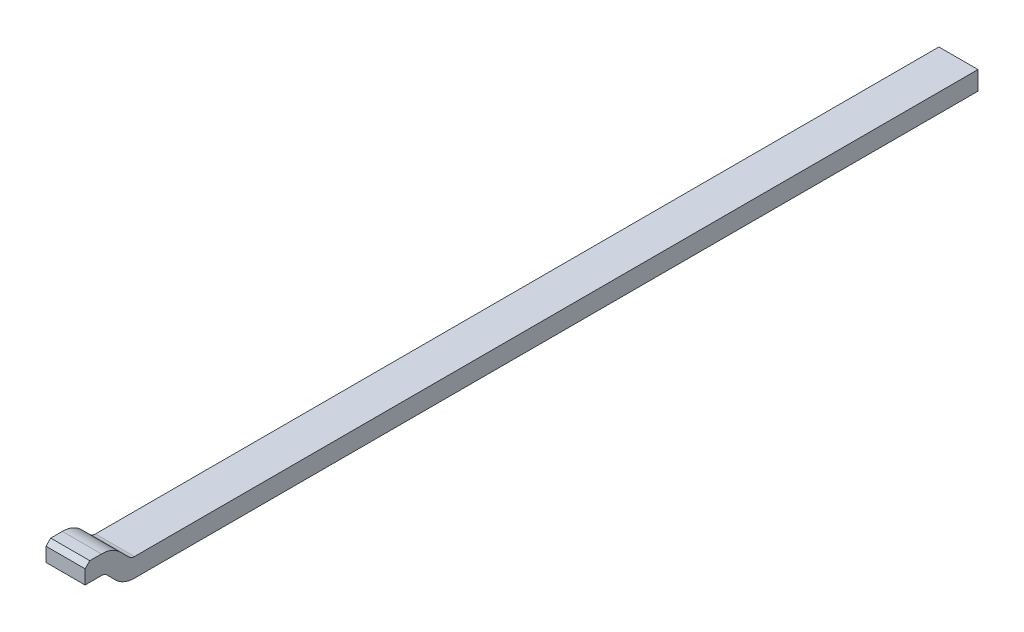
ISO-10303-21;
HEADER;
FILE_DESCRIPTION(('STEP AP214'),'2;1');
FILE_NAME('part.step','',(''),(''),'','','');
FILE_SCHEMA(('AUTOMOTIVE_DESIGN { 1 0 10303 214 1 1 1 1 }'));
ENDSEC;
DATA;
#1=APPLICATION_CONTEXT('core data for automotive mechanical design processes');
#2=APPLICATION_PROTOCOL_DEFINITION('international standard','automotive_design',2000,#1);
#3=PRODUCT_CONTEXT('',#1,'mechanical');
#4=PRODUCT('Part','Part','',(#3));
#5=PRODUCT_RELATED_PRODUCT_CATEGORY('part','',(#4));
#6=PRODUCT_DEFINITION_FORMATION('','',#4);
#7=PRODUCT_DEFINITION_CONTEXT('part definition',#1,'design');
#8=PRODUCT_DEFINITION('design','',#6,#7);
#9=PRODUCT_DEFINITION_SHAPE('','',#8);
#10=(LENGTH_UNIT() NAMED_UNIT(*) SI_UNIT(.MILLI.,.METRE.));
#11=(NAMED_UNIT(*) PLANE_ANGLE_UNIT() SI_UNIT($,.RADIAN.));
#12=(NAMED_UNIT(*) SI_UNIT($,.STERADIAN.) SOLID_ANGLE_UNIT());
#13=UNCERTAINTY_MEASURE_WITH_UNIT(LENGTH_MEASURE(1.E-05),#10,'distance_accuracy_value','');
#14=(GEOMETRIC_REPRESENTATION_CONTEXT(3) GLOBAL_UNCERTAINTY_ASSIGNED_CONTEXT((#13)) GLOBAL_UNIT_ASSIGNED_CONTEXT((#10,
#11,#12)) REPRESENTATION_CONTEXT('',''));
#15=CARTESIAN_POINT('',(0.,0.,0.));
#16=DIRECTION('',(0.,0.,1.));
#17=DIRECTION('',(1.,0.,0.));
#18=AXIS2_PLACEMENT_3D('',#15,#16,#17);
#19=CARTESIAN_POINT('',(16.16210823521,13.39951558355,-5.731698833076));
#20=DIRECTION('',(1.,0.,0.));
#21=DIRECTION('',(0.,0.,-1.));
#22=AXIS2_PLACEMENT_3D('',#19,#20,#21);
#23=PLANE('',#22);
#24=DIRECTION('',(0.,0.,-1.));
#25=VECTOR('',#24,1.);
#26=CARTESIAN_POINT('',(16.16210820552,12.93951558355,-11.38169883308));
#27=LINE('',#26,#25);
#28=CARTESIAN_POINT('',(16.1621082058651,12.93951558355,-5.77711513867901));
#29=VERTEX_POINT('',#28);
#30=CARTESIAN_POINT('',(16.1621082205483,12.93951558355,-11.17169883308));
#31=VERTEX_POINT('',#30);
#32=EDGE_CURVE('E28',#29,#31,#27,.T.);
#33=ORIENTED_EDGE('',*,*,#32,.T.);
#34=DIRECTION('',(0.,1.,0.));
#35=VECTOR('',#34,1.);
#36=CARTESIAN_POINT('',(16.16210823521,11.48941215274,-11.17169883308));
#37=LINE('',#36,#35);
#38=CARTESIAN_POINT('',(16.1621082205483,12.81951558355,-11.17169883308));
#39=VERTEX_POINT('',#38);
#40=EDGE_CURVE('E191',#39,#31,#37,.T.);
#41=ORIENTED_EDGE('',*,*,#40,.F.);
#42=DIRECTION('',(0.,0.,-1.));
#43=VECTOR('',#42,1.);
#44=CARTESIAN_POINT('',(16.16210820552,12.81951558355,-5.731698833076));
#45=LINE('',#44,#43);
#46=CARTESIAN_POINT('',(16.1621082058651,12.81951558355,-5.77711513867905));
#47=VERTEX_POINT('',#46);
#48=EDGE_CURVE('E227',#47,#39,#45,.T.);
#49=ORIENTED_EDGE('',*,*,#48,.F.);
#50=CARTESIAN_POINT('',(16.16210820552,12.98951558355,-5.777115138679));
#51=DIRECTION('',(1.,0.,0.));
#52=DIRECTION('',(0.,0.,1.));
#53=AXIS2_PLACEMENT_3D('',#50,#51,#52);
#54=CIRCLE('',#53,0.17);
#55=CARTESIAN_POINT('',(16.1621082058651,12.8693074307492,-5.65690698587737));
#56=VERTEX_POINT('',#55);
#57=EDGE_CURVE('E21',#56,#47,#54,.T.);
#58=ORIENTED_EDGE('',*,*,#57,.F.);
#59=DIRECTION('',(0.,-0.707106781180048,-0.707106781193047));
#60=VECTOR('',#59,1.);
#61=CARTESIAN_POINT('',(16.16210820552,12.92487092261,-5.601343494017));
#62=LINE('',#61,#60);
#63=CARTESIAN_POINT('',(16.1621082058651,12.9248709226098,-5.60134349401678));
#64=VERTEX_POINT('',#63);
#65=EDGE_CURVE('E201',#64,#56,#62,.T.);
#66=ORIENTED_EDGE('',*,*,#65,.F.);
#67=CARTESIAN_POINT('',(16.16210820552,12.88951558355,-5.565988154957));
#68=DIRECTION('',(-1.,0.,0.));
#69=DIRECTION('',(0.,0.,1.));
#70=AXIS2_PLACEMENT_3D('',#67,#68,#69);
#71=CIRCLE('',#70,0.05);
#72=CARTESIAN_POINT('',(16.1621082058651,12.93951558355,-5.565988154957));
#73=VERTEX_POINT('',#72);
#74=EDGE_CURVE('E180',#73,#64,#71,.T.);
#75=ORIENTED_EDGE('',*,*,#74,.F.);
#76=DIRECTION('',(0.,0.,-1.));
#77=VECTOR('',#76,1.);
#78=CARTESIAN_POINT('',(16.16210820552,12.93951558355,-5.731698833076));
#79=LINE('',#78,#77);
#80=CARTESIAN_POINT('',(16.1621082058651,12.93951558355,-5.461404460561));
#81=VERTEX_POINT('',#80);
#82=EDGE_CURVE('E181',#81,#73,#79,.T.);
#83=ORIENTED_EDGE('',*,*,#82,.F.);
#84=DIRECTION('',(0.,-1.,0.));
#85=VECTOR('',#84,1.);
#86=CARTESIAN_POINT('',(16.16210820552,12.93951558355,-5.461404460561));
#87=LINE('',#86,#85);
#88=CARTESIAN_POINT('',(16.1621082058651,13.02951558355,-5.461404460561));
#89=VERTEX_POINT('',#88);
#90=EDGE_CURVE('E234',#89,#81,#87,.T.);
#91=ORIENTED_EDGE('',*,*,#90,.F.);
#92=DIRECTION('',(0.,-0.707106781186548,0.707106781186548));
#93=VECTOR('',#92,1.);
#94=CARTESIAN_POINT('',(16.16210820552,13.05951558355,-5.491404460561));
#95=LINE('',#94,#93);
#96=CARTESIAN_POINT('',(16.1621082058651,13.05951558355,-5.491404460561));
#97=VERTEX_POINT('',#96);
#98=EDGE_CURVE('E186',#97,#89,#95,.T.);
#99=ORIENTED_EDGE('',*,*,#98,.F.);
#100=DIRECTION('',(0.,0.,1.));
#101=VECTOR('',#100,1.);
#102=CARTESIAN_POINT('',(16.16210820552,13.05951558355,-5.731698833076));
#103=LINE('',#102,#101);
#104=CARTESIAN_POINT('',(16.1621082058651,13.05951558355,-5.565988154957));
#105=VERTEX_POINT('',#104);
#106=EDGE_CURVE('E242',#105,#97,#103,.T.);
#107=ORIENTED_EDGE('',*,*,#106,.F.);
#108=CARTESIAN_POINT('',(16.16210820552,12.88951558355,-5.565988154957));
#109=DIRECTION('',(1.,0.,0.));
#110=DIRECTION('',(0.,0.,1.));
#111=AXIS2_PLACEMENT_3D('',#108,#109,#110);
#112=CIRCLE('',#111,0.17);
#113=CARTESIAN_POINT('',(16.1621082058651,13.0097237363508,-5.68619630775937));
#114=VERTEX_POINT('',#113);
#115=EDGE_CURVE('E247',#114,#105,#112,.T.);
#116=ORIENTED_EDGE('',*,*,#115,.F.);
#117=DIRECTION('',(0.,0.707106781180048,0.707106781193047));
#118=VECTOR('',#117,1.);
#119=CARTESIAN_POINT('',(16.16210820552,12.95416024449,-5.74175979962));
#120=LINE('',#119,#118);
#121=CARTESIAN_POINT('',(16.1621082058651,12.9541602444904,-5.74175979962039));
#122=VERTEX_POINT('',#121);
#123=EDGE_CURVE('E174',#122,#114,#120,.T.);
#124=ORIENTED_EDGE('',*,*,#123,.F.);
#125=CARTESIAN_POINT('',(16.16210820552,12.98951558355,-5.777115138679));
#126=DIRECTION('',(-1.,0.,0.));
#127=DIRECTION('',(0.,0.,1.));
#128=AXIS2_PLACEMENT_3D('',#125,#126,#127);
#129=CIRCLE('',#128,0.05);
#130=EDGE_CURVE('E205',#29,#122,#129,.T.);
#131=ORIENTED_EDGE('',*,*,#130,.F.);
#132=EDGE_LOOP('',(#33,#41,#49,#58,#66,#75,#83,#91,#99,#107,#116,#124,#131));
#133=FACE_BOUND('',#132,.T.);
#134=ADVANCED_FACE('F17',(#133),#23,.F.);
#135=CARTESIAN_POINT('',(16.41210823521,13.67951558355,-12.98169883308));
#136=DIRECTION('',(1.,0.,0.));
#137=DIRECTION('',(0.,0.,-1.));
#138=AXIS2_PLACEMENT_3D('',#135,#136,#137);
#139=PLANE('',#138);
#140=DIRECTION('',(0.,1.,0.));
#141=VECTOR('',#140,1.);
#142=CARTESIAN_POINT('',(16.41210823521,11.48941215274,-11.17169883308));
#143=LINE('',#142,#141);
#144=CARTESIAN_POINT('',(16.4121082205483,12.81951558355,-11.17169883308));
#145=VERTEX_POINT('',#144);
#146=CARTESIAN_POINT('',(16.4121082205483,12.93951558355,-11.17169883308));
#147=VERTEX_POINT('',#146);
#148=EDGE_CURVE('E194',#145,#147,#143,.T.);
#149=ORIENTED_EDGE('',*,*,#148,.T.);
#150=DIRECTION('',(0.,0.,1.));
#151=VECTOR('',#150,1.);
#152=CARTESIAN_POINT('',(16.41210820552,12.93951558355,-12.98169883308));
#153=LINE('',#152,#151);
#154=CARTESIAN_POINT('',(16.4121082058651,12.93951558355,-5.77711513867901));
#155=VERTEX_POINT('',#154);
#156=EDGE_CURVE('E11',#147,#155,#153,.T.);
#157=ORIENTED_EDGE('',*,*,#156,.T.);
#158=CARTESIAN_POINT('',(16.41210820552,12.98951558355,-5.777115138679));
#159=DIRECTION('',(-1.,0.,0.));
#160=DIRECTION('',(0.,0.,1.));
#161=AXIS2_PLACEMENT_3D('',#158,#159,#160);
#162=CIRCLE('',#161,0.05);
#163=CARTESIAN_POINT('',(16.4121082058651,12.9541602444904,-5.74175979962039));
#164=VERTEX_POINT('',#163);
#165=EDGE_CURVE('E208',#155,#164,#162,.T.);
#166=ORIENTED_EDGE('',*,*,#165,.T.);
#167=DIRECTION('',(0.,0.707106781180048,0.707106781193047));
#168=VECTOR('',#167,1.);
#169=CARTESIAN_POINT('',(16.41210820552,12.95416024449,-5.74175979962));
#170=LINE('',#169,#168);
#171=CARTESIAN_POINT('',(16.4121082058651,13.0097237363508,-5.68619630775937));
#172=VERTEX_POINT('',#171);
#173=EDGE_CURVE('E243',#164,#172,#170,.T.);
#174=ORIENTED_EDGE('',*,*,#173,.T.);
#175=CARTESIAN_POINT('',(16.41210820552,12.88951558355,-5.565988154957));
#176=DIRECTION('',(1.,0.,0.));
#177=DIRECTION('',(0.,0.,1.));
#178=AXIS2_PLACEMENT_3D('',#175,#176,#177);
#179=CIRCLE('',#178,0.17);
#180=CARTESIAN_POINT('',(16.4121082058651,13.05951558355,-5.565988154957));
#181=VERTEX_POINT('',#180);
#182=EDGE_CURVE('E210',#172,#181,#179,.T.);
#183=ORIENTED_EDGE('',*,*,#182,.T.);
#184=DIRECTION('',(0.,0.,1.));
#185=VECTOR('',#184,1.);
#186=CARTESIAN_POINT('',(16.41210820552,13.05951558355,-12.98169883308));
#187=LINE('',#186,#185);
#188=CARTESIAN_POINT('',(16.4121082058651,13.05951558355,-5.491404460561));
#189=VERTEX_POINT('',#188);
#190=EDGE_CURVE('E214',#181,#189,#187,.T.);
#191=ORIENTED_EDGE('',*,*,#190,.T.);
#192=DIRECTION('',(0.,-0.707106781186548,0.707106781186548));
#193=VECTOR('',#192,1.);
#194=CARTESIAN_POINT('',(16.41210820552,13.05951558355,-5.491404460561));
#195=LINE('',#194,#193);
#196=CARTESIAN_POINT('',(16.4121082058651,13.02951558355,-5.461404460561));
#197=VERTEX_POINT('',#196);
#198=EDGE_CURVE('E235',#189,#197,#195,.T.);
#199=ORIENTED_EDGE('',*,*,#198,.T.);
#200=DIRECTION('',(0.,-1.,0.));
#201=VECTOR('',#200,1.);
#202=CARTESIAN_POINT('',(16.41210820552,12.65951558355,-5.461404460561));
#203=LINE('',#202,#201);
#204=CARTESIAN_POINT('',(16.4121082058651,12.93951558355,-5.461404460561));
#205=VERTEX_POINT('',#204);
#206=EDGE_CURVE('E184',#197,#205,#203,.T.);
#207=ORIENTED_EDGE('',*,*,#206,.T.);
#208=DIRECTION('',(0.,0.,-1.));
#209=VECTOR('',#208,1.);
#210=CARTESIAN_POINT('',(16.41210820552,12.93951558355,-12.98169883308));
#211=LINE('',#210,#209);
#212=CARTESIAN_POINT('',(16.4121082058651,12.93951558355,-5.565988154957));
#213=VERTEX_POINT('',#212);
#214=EDGE_CURVE('E179',#205,#213,#211,.T.);
#215=ORIENTED_EDGE('',*,*,#214,.T.);
#216=CARTESIAN_POINT('',(16.41210820552,12.88951558355,-5.565988154957));
#217=DIRECTION('',(-1.,0.,0.));
#218=DIRECTION('',(0.,0.,1.));
#219=AXIS2_PLACEMENT_3D('',#216,#217,#218);
#220=CIRCLE('',#219,0.05);
#221=CARTESIAN_POINT('',(16.4121082058651,12.9248709226098,-5.60134349401678));
#222=VERTEX_POINT('',#221);
#223=EDGE_CURVE('E176',#213,#222,#220,.T.);
#224=ORIENTED_EDGE('',*,*,#223,.T.);
#225=DIRECTION('',(0.,-0.707106781180048,-0.707106781193047));
#226=VECTOR('',#225,1.);
#227=CARTESIAN_POINT('',(16.41210820552,12.92487092261,-5.601343494017));
#228=LINE('',#227,#226);
#229=CARTESIAN_POINT('',(16.4121082058651,12.8693074307492,-5.65690698587737));
#230=VERTEX_POINT('',#229);
#231=EDGE_CURVE('E157',#222,#230,#228,.T.);
#232=ORIENTED_EDGE('',*,*,#231,.T.);
#233=CARTESIAN_POINT('',(16.41210820552,12.98951558355,-5.777115138679));
#234=DIRECTION('',(1.,0.,0.));
#235=DIRECTION('',(0.,0.,1.));
#236=AXIS2_PLACEMENT_3D('',#233,#234,#235);
#237=CIRCLE('',#236,0.17);
#238=CARTESIAN_POINT('',(16.4121082058651,12.81951558355,-5.77711513867905));
#239=VERTEX_POINT('',#238);
#240=EDGE_CURVE('E154',#230,#239,#237,.T.);
#241=ORIENTED_EDGE('',*,*,#240,.T.);
#242=DIRECTION('',(0.,0.,-1.));
#243=VECTOR('',#242,1.);
#244=CARTESIAN_POINT('',(16.41210820552,12.81951558355,-12.98169883308));
#245=LINE('',#244,#243);
#246=EDGE_CURVE('E139',#239,#145,#245,.T.);
#247=ORIENTED_EDGE('',*,*,#246,.T.);
#248=EDGE_LOOP('',(#149,#157,#166,#174,#183,#191,#199,#207,#215,#224,#232,#241,#247));
#249=FACE_BOUND('',#248,.T.);
#250=ADVANCED_FACE('F155',(#249),#139,.T.);
#251=CARTESIAN_POINT('',(12.51210817501,12.93951558355,-11.38169883308));
#252=DIRECTION('',(0.,-1.,0.));
#253=DIRECTION('',(0.,0.,-1.));
#254=AXIS2_PLACEMENT_3D('',#251,#252,#253);
#255=PLANE('',#254);
#256=ORIENTED_EDGE('',*,*,#32,.F.);
#257=DIRECTION('',(-1.,0.,0.));
#258=VECTOR('',#257,1.);
#259=CARTESIAN_POINT('',(12.51210817501,12.93951558355,-5.777115138679));
#260=LINE('',#259,#258);
#261=EDGE_CURVE('E209',#155,#29,#260,.T.);
#262=ORIENTED_EDGE('',*,*,#261,.F.);
#263=ORIENTED_EDGE('',*,*,#156,.F.);
#264=DIRECTION('',(-1.,0.,0.));
#265=VECTOR('',#264,1.);
#266=CARTESIAN_POINT('',(13.11210817501,12.93951558355,-11.17169883308));
#267=LINE('',#266,#265);
#268=EDGE_CURVE('E150',#147,#31,#267,.T.);
#269=ORIENTED_EDGE('',*,*,#268,.T.);
#270=EDGE_LOOP('',(#256,#262,#263,#269));
#271=FACE_BOUND('',#270,.T.);
#272=ADVANCED_FACE('F288',(#271),#255,.F.);
#273=CARTESIAN_POINT('',(13.11210817501,5.079903349409,-11.17169883308));
#274=DIRECTION('',(0.,0.,-1.));
#275=DIRECTION('',(-1.,0.,0.));
#276=AXIS2_PLACEMENT_3D('',#273,#274,#275);
#277=PLANE('',#276);
#278=ORIENTED_EDGE('',*,*,#268,.F.);
#279=ORIENTED_EDGE('',*,*,#148,.F.);
#280=DIRECTION('',(-1.,0.,0.));
#281=VECTOR('',#280,1.);
#282=CARTESIAN_POINT('',(13.11210817501,12.81951558355,-11.17169883308));
#283=LINE('',#282,#281);
#284=EDGE_CURVE('E146',#145,#39,#283,.T.);
#285=ORIENTED_EDGE('',*,*,#284,.T.);
#286=ORIENTED_EDGE('',*,*,#40,.T.);
#287=EDGE_LOOP('',(#278,#279,#285,#286));
#288=FACE_BOUND('',#287,.T.);
#289=ADVANCED_FACE('F280',(#288),#277,.T.);
#290=CARTESIAN_POINT('',(0.,12.81951558355,0.));
#291=DIRECTION('',(0.,-1.,0.));
#292=DIRECTION('',(0.,0.,-1.));
#293=AXIS2_PLACEMENT_3D('',#290,#291,#292);
#294=PLANE('',#293);
#295=ORIENTED_EDGE('',*,*,#48,.T.);
#296=ORIENTED_EDGE('',*,*,#284,.F.);
#297=ORIENTED_EDGE('',*,*,#246,.F.);
#298=DIRECTION('',(-1.,0.,0.));
#299=VECTOR('',#298,1.);
#300=CARTESIAN_POINT('',(0.,12.81951558355,-5.777115138679));
#301=LINE('',#300,#299);
#302=EDGE_CURVE('E144',#239,#47,#301,.T.);
#303=ORIENTED_EDGE('',*,*,#302,.T.);
#304=EDGE_LOOP('',(#295,#296,#297,#303));
#305=FACE_BOUND('',#304,.T.);
#306=ADVANCED_FACE('F142',(#305),#294,.T.);
#307=CARTESIAN_POINT('',(12.51210817501,12.98951558355,-5.777115138679));
#308=DIRECTION('',(1.,0.,0.));
#309=DIRECTION('',(0.,0.,1.));
#310=AXIS2_PLACEMENT_3D('',#307,#308,#309);
#311=CYLINDRICAL_SURFACE('',#310,0.05);
#312=ORIENTED_EDGE('',*,*,#261,.T.);
#313=ORIENTED_EDGE('',*,*,#130,.T.);
#314=DIRECTION('',(-1.,0.,0.));
#315=VECTOR('',#314,1.);
#316=CARTESIAN_POINT('',(16.91210820408,12.954160244491,-5.741759799621));
#317=LINE('',#316,#315);
#318=EDGE_CURVE('E246',#164,#122,#317,.T.);
#319=ORIENTED_EDGE('',*,*,#318,.F.);
#320=ORIENTED_EDGE('',*,*,#165,.F.);
#321=EDGE_LOOP('',(#312,#313,#319,#320));
#322=FACE_BOUND('',#321,.T.);
#323=ADVANCED_FACE('F286',(#322),#311,.F.);
#324=CARTESIAN_POINT('',(16.91210820408,12.93951558355,-5.756404460561));
#325=DIRECTION('',(0.,0.707106781186548,-0.707106781186548));
#326=DIRECTION('',(-1.,0.,0.));
#327=AXIS2_PLACEMENT_3D('',#324,#325,#326);
#328=PLANE('',#327);
#329=DIRECTION('',(-1.,0.,0.));
#330=VECTOR('',#329,1.);
#331=CARTESIAN_POINT('',(16.91210820408,13.009723736351,-5.68619630776));
#332=LINE('',#331,#330);
#333=EDGE_CURVE('E213',#172,#114,#332,.T.);
#334=ORIENTED_EDGE('',*,*,#333,.F.);
#335=ORIENTED_EDGE('',*,*,#173,.F.);
#336=ORIENTED_EDGE('',*,*,#318,.T.);
#337=ORIENTED_EDGE('',*,*,#123,.T.);
#338=EDGE_LOOP('',(#334,#335,#336,#337));
#339=FACE_BOUND('',#338,.T.);
#340=ADVANCED_FACE('F19',(#339),#328,.T.);
#341=CARTESIAN_POINT('',(16.91210820408,12.88951558355,-5.565988154957));
#342=DIRECTION('',(1.,0.,0.));
#343=DIRECTION('',(0.,0.,1.));
#344=AXIS2_PLACEMENT_3D('',#341,#342,#343);
#345=CYLINDRICAL_SURFACE('',#344,0.17);
#346=DIRECTION('',(-1.,0.,0.));
#347=VECTOR('',#346,1.);
#348=CARTESIAN_POINT('',(16.91210820408,13.05951558355,-5.565988154957));
#349=LINE('',#348,#347);
#350=EDGE_CURVE('E189',#181,#105,#349,.T.);
#351=ORIENTED_EDGE('',*,*,#350,.F.);
#352=ORIENTED_EDGE('',*,*,#182,.F.);
#353=ORIENTED_EDGE('',*,*,#333,.T.);
#354=ORIENTED_EDGE('',*,*,#115,.T.);
#355=EDGE_LOOP('',(#351,#352,#353,#354));
#356=FACE_BOUND('',#355,.T.);
#357=ADVANCED_FACE('F304',(#356),#345,.T.);
#358=CARTESIAN_POINT('',(16.91210820408,13.05951558355,-5.661404460561));
#359=DIRECTION('',(0.,1.,0.));
#360=DIRECTION('',(1.,0.,0.));
#361=AXIS2_PLACEMENT_3D('',#358,#359,#360);
#362=PLANE('',#361);
#363=ORIENTED_EDGE('',*,*,#350,.T.);
#364=ORIENTED_EDGE('',*,*,#106,.T.);
#365=DIRECTION('',(1.,0.,0.));
#366=VECTOR('',#365,1.);
#367=CARTESIAN_POINT('',(16.91210820408,13.05951558355,-5.491404460561));
#368=LINE('',#367,#366);
#369=EDGE_CURVE('E190',#97,#189,#368,.T.);
#370=ORIENTED_EDGE('',*,*,#369,.T.);
#371=ORIENTED_EDGE('',*,*,#190,.F.);
#372=EDGE_LOOP('',(#363,#364,#370,#371));
#373=FACE_BOUND('',#372,.T.);
#374=ADVANCED_FACE('F301',(#373),#362,.T.);
#375=CARTESIAN_POINT('',(16.91210820408,13.05951558355,-5.491404460561));
#376=DIRECTION('',(0.,-0.707106781187048,-0.707106781186048));
#377=DIRECTION('',(0.,0.707106781186048,-0.707106781187048));
#378=AXIS2_PLACEMENT_3D('',#375,#376,#377);
#379=PLANE('',#378);
#380=DIRECTION('',(-1.,0.,0.));
#381=VECTOR('',#380,1.);
#382=CARTESIAN_POINT('',(16.91210820408,13.02951558355,-5.461404460561));
#383=LINE('',#382,#381);
#384=EDGE_CURVE('E217',#197,#89,#383,.T.);
#385=ORIENTED_EDGE('',*,*,#384,.F.);
#386=ORIENTED_EDGE('',*,*,#198,.F.);
#387=ORIENTED_EDGE('',*,*,#369,.F.);
#388=ORIENTED_EDGE('',*,*,#98,.T.);
#389=EDGE_LOOP('',(#385,#386,#387,#388));
#390=FACE_BOUND('',#389,.T.);
#391=ADVANCED_FACE('F475',(#390),#379,.F.);
#392=CARTESIAN_POINT('',(16.91210820408,13.05951558355,-5.461404460561));
#393=DIRECTION('',(0.,0.,1.));
#394=DIRECTION('',(1.,0.,0.));
#395=AXIS2_PLACEMENT_3D('',#392,#393,#394);
#396=PLANE('',#395);
#397=DIRECTION('',(1.,0.,0.));
#398=VECTOR('',#397,1.);
#399=CARTESIAN_POINT('',(17.5653424523,12.93951558355,-5.461404460561));
#400=LINE('',#399,#398);
#401=EDGE_CURVE('E185',#81,#205,#400,.T.);
#402=ORIENTED_EDGE('',*,*,#401,.T.);
#403=ORIENTED_EDGE('',*,*,#206,.F.);
#404=ORIENTED_EDGE('',*,*,#384,.T.);
#405=ORIENTED_EDGE('',*,*,#90,.T.);
#406=EDGE_LOOP('',(#402,#403,#404,#405));
#407=FACE_BOUND('',#406,.T.);
#408=ADVANCED_FACE('F464',(#407),#396,.T.);
#409=CARTESIAN_POINT('',(17.5653424523,12.93951558355,-5.535988154957));
#410=DIRECTION('',(0.,1.,-1.444831928366E-13));
#411=DIRECTION('',(0.,-1.444831928366E-13,-1.));
#412=AXIS2_PLACEMENT_3D('',#409,#410,#411);
#413=PLANE('',#412);
#414=ORIENTED_EDGE('',*,*,#214,.F.);
#415=ORIENTED_EDGE('',*,*,#401,.F.);
#416=ORIENTED_EDGE('',*,*,#82,.T.);
#417=DIRECTION('',(1.,0.,0.));
#418=VECTOR('',#417,1.);
#419=CARTESIAN_POINT('',(16.91210820408,12.93951558355,-5.565988154957));
#420=LINE('',#419,#418);
#421=EDGE_CURVE('E195',#73,#213,#420,.T.);
#422=ORIENTED_EDGE('',*,*,#421,.T.);
#423=EDGE_LOOP('',(#414,#415,#416,#422));
#424=FACE_BOUND('',#423,.T.);
#425=ADVANCED_FACE('F452',(#424),#413,.F.);
#426=CARTESIAN_POINT('',(16.91210820408,12.88951558355,-5.565988154957));
#427=DIRECTION('',(1.,0.,0.));
#428=DIRECTION('',(0.,0.,1.));
#429=AXIS2_PLACEMENT_3D('',#426,#427,#428);
#430=CYLINDRICAL_SURFACE('',#429,0.05);
#431=ORIENTED_EDGE('',*,*,#421,.F.);
#432=ORIENTED_EDGE('',*,*,#74,.T.);
#433=DIRECTION('',(-1.,0.,0.));
#434=VECTOR('',#433,1.);
#435=CARTESIAN_POINT('',(16.91210820408,12.92487092261,-5.601343494017));
#436=LINE('',#435,#434);
#437=EDGE_CURVE('E204',#222,#64,#436,.T.);
#438=ORIENTED_EDGE('',*,*,#437,.F.);
#439=ORIENTED_EDGE('',*,*,#223,.F.);
#440=EDGE_LOOP('',(#431,#432,#438,#439));
#441=FACE_BOUND('',#440,.T.);
#442=ADVANCED_FACE('F440',(#441),#430,.F.);
#443=CARTESIAN_POINT('',(16.91210820408,12.93951558355,-5.586698833076));
#444=DIRECTION('',(0.,-0.707106781186048,0.707106781187048));
#445=DIRECTION('',(-1.,0.,0.));
#446=AXIS2_PLACEMENT_3D('',#443,#444,#445);
#447=PLANE('',#446);
#448=ORIENTED_EDGE('',*,*,#437,.T.);
#449=ORIENTED_EDGE('',*,*,#65,.T.);
#450=DIRECTION('',(-1.,0.,0.));
#451=VECTOR('',#450,1.);
#452=CARTESIAN_POINT('',(13.06210817501,12.869307430749,-5.656906985877));
#453=LINE('',#452,#451);
#454=EDGE_CURVE('E162',#230,#56,#453,.T.);
#455=ORIENTED_EDGE('',*,*,#454,.F.);
#456=ORIENTED_EDGE('',*,*,#231,.F.);
#457=EDGE_LOOP('',(#448,#449,#455,#456));
#458=FACE_BOUND('',#457,.T.);
#459=ADVANCED_FACE('F429',(#458),#447,.T.);
#460=CARTESIAN_POINT('',(13.06210817501,12.98951558355,-5.777115138679));
#461=DIRECTION('',(1.,0.,0.));
#462=DIRECTION('',(0.,0.,1.));
#463=AXIS2_PLACEMENT_3D('',#460,#461,#462);
#464=CYLINDRICAL_SURFACE('',#463,0.17);
#465=ORIENTED_EDGE('',*,*,#302,.F.);
#466=ORIENTED_EDGE('',*,*,#240,.F.);
#467=ORIENTED_EDGE('',*,*,#454,.T.);
#468=ORIENTED_EDGE('',*,*,#57,.T.);
#469=EDGE_LOOP('',(#465,#466,#467,#468));
#470=FACE_BOUND('',#469,.T.);
#471=ADVANCED_FACE('F165',(#470),#464,.T.);
#472=CLOSED_SHELL('',(#134,#250,#272,#289,#306,#323,#340,#357,#374,#391,#408,#425,#442,#459,#471));
#473=MANIFOLD_SOLID_BREP('B1',#472);
#474=ADVANCED_BREP_SHAPE_REPRESENTATION('',(#18,#473),#14);
#475=SHAPE_DEFINITION_REPRESENTATION(#9,#474);
ENDSEC;
END-ISO-10303-21;
